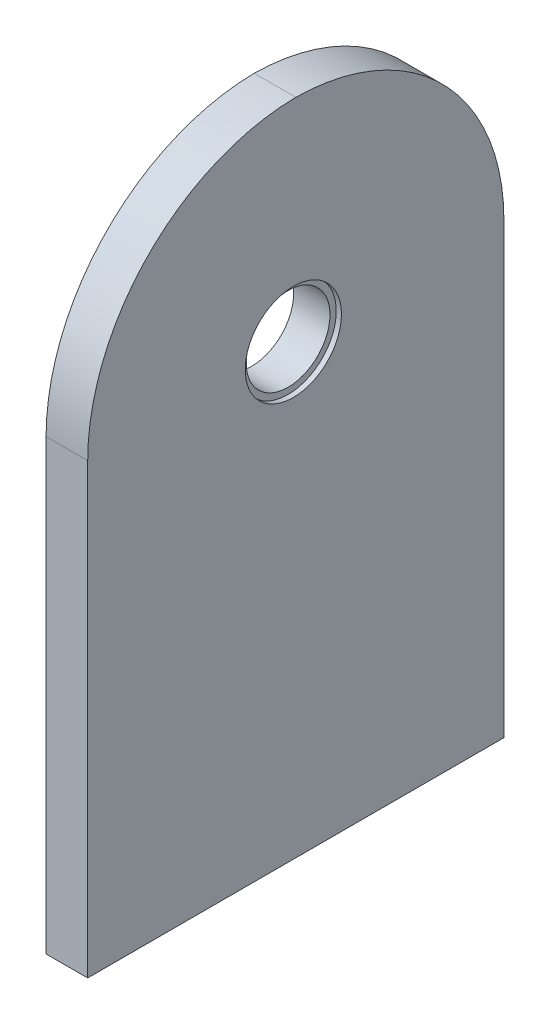
ISO-10303-21;
HEADER;
FILE_DESCRIPTION(('STEP AP214'),'2;1');
FILE_NAME('part.step','',(''),(''),'','','');
FILE_SCHEMA(('AUTOMOTIVE_DESIGN { 1 0 10303 214 1 1 1 1 }'));
ENDSEC;
DATA;
#1=APPLICATION_CONTEXT('core data for automotive mechanical design processes');
#2=APPLICATION_PROTOCOL_DEFINITION('international standard','automotive_design',2000,#1);
#3=PRODUCT_CONTEXT('',#1,'mechanical');
#4=PRODUCT('Part','Part','',(#3));
#5=PRODUCT_RELATED_PRODUCT_CATEGORY('part','',(#4));
#6=PRODUCT_DEFINITION_FORMATION('','',#4);
#7=PRODUCT_DEFINITION_CONTEXT('part definition',#1,'design');
#8=PRODUCT_DEFINITION('design','',#6,#7);
#9=PRODUCT_DEFINITION_SHAPE('','',#8);
#10=(LENGTH_UNIT() NAMED_UNIT(*) SI_UNIT(.MILLI.,.METRE.));
#11=(NAMED_UNIT(*) PLANE_ANGLE_UNIT() SI_UNIT($,.RADIAN.));
#12=(NAMED_UNIT(*) SI_UNIT($,.STERADIAN.) SOLID_ANGLE_UNIT());
#13=UNCERTAINTY_MEASURE_WITH_UNIT(LENGTH_MEASURE(1.E-05),#10,'distance_accuracy_value','');
#14=(GEOMETRIC_REPRESENTATION_CONTEXT(3) GLOBAL_UNCERTAINTY_ASSIGNED_CONTEXT((#13)) GLOBAL_UNIT_ASSIGNED_CONTEXT((#10,
#11,#12)) REPRESENTATION_CONTEXT('',''));
#15=CARTESIAN_POINT('',(0.,0.,0.));
#16=DIRECTION('',(0.,0.,1.));
#17=DIRECTION('',(1.,0.,0.));
#18=AXIS2_PLACEMENT_3D('',#15,#16,#17);
#19=CARTESIAN_POINT('',(144.666666666667,10.,39.6428499928494));
#20=DIRECTION('',(0.,1.,0.));
#21=DIRECTION('',(0.,0.,1.));
#22=AXIS2_PLACEMENT_3D('',#19,#20,#21);
#23=PLANE('',#22);
#24=CARTESIAN_POINT('',(64.,10.,30.));
#25=DIRECTION('',(0.,-1.,0.));
#26=DIRECTION('',(0.,0.,-1.));
#27=AXIS2_PLACEMENT_3D('',#24,#25,#26);
#28=CIRCLE('',#27,1.64999999999998);
#29=CARTESIAN_POINT('',(64.,10.,28.35));
#30=VERTEX_POINT('',#29);
#31=EDGE_CURVE('E104',#30,#30,#28,.T.);
#32=ORIENTED_EDGE('',*,*,#31,.F.);
#33=EDGE_LOOP('',(#32));
#34=FACE_BOUND('',#33,.T.);
#35=CARTESIAN_POINT('',(64.,10.,0.));
#36=DIRECTION('',(0.,-1.,0.));
#37=DIRECTION('',(0.,0.,-1.));
#38=AXIS2_PLACEMENT_3D('',#35,#36,#37);
#39=CIRCLE('',#38,1.64999999999998);
#40=CARTESIAN_POINT('',(64.,10.,-1.64999999999998));
#41=VERTEX_POINT('',#40);
#42=EDGE_CURVE('E103',#41,#41,#39,.T.);
#43=ORIENTED_EDGE('',*,*,#42,.F.);
#44=EDGE_LOOP('',(#43));
#45=FACE_BOUND('',#44,.T.);
#46=CARTESIAN_POINT('',(64.,10.,-30.));
#47=DIRECTION('',(0.,-1.,0.));
#48=DIRECTION('',(0.,0.,-1.));
#49=AXIS2_PLACEMENT_3D('',#46,#47,#48);
#50=CIRCLE('',#49,1.64999999999998);
#51=CARTESIAN_POINT('',(64.,10.,-31.65));
#52=VERTEX_POINT('',#51);
#53=EDGE_CURVE('E114',#52,#52,#50,.T.);
#54=ORIENTED_EDGE('',*,*,#53,.F.);
#55=EDGE_LOOP('',(#54));
#56=FACE_BOUND('',#55,.T.);
#57=DIRECTION('',(0.,0.,-1.));
#58=VECTOR('',#57,1.);
#59=CARTESIAN_POINT('',(68.,10.,-40.));
#60=LINE('',#59,#58);
#61=CARTESIAN_POINT('',(68.,10.,40.));
#62=VERTEX_POINT('',#61);
#63=CARTESIAN_POINT('',(68.,10.,-40.));
#64=VERTEX_POINT('',#63);
#65=EDGE_CURVE('E45',#62,#64,#60,.T.);
#66=ORIENTED_EDGE('',*,*,#65,.F.);
#67=DIRECTION('',(1.,0.,0.));
#68=VECTOR('',#67,1.);
#69=CARTESIAN_POINT('',(60.,10.,40.));
#70=LINE('',#69,#68);
#71=CARTESIAN_POINT('',(60.,10.,40.));
#72=VERTEX_POINT('',#71);
#73=EDGE_CURVE('E139',#72,#62,#70,.T.);
#74=ORIENTED_EDGE('',*,*,#73,.F.);
#75=DIRECTION('',(0.,0.,1.));
#76=VECTOR('',#75,1.);
#77=CARTESIAN_POINT('',(60.,10.,-40.));
#78=LINE('',#77,#76);
#79=CARTESIAN_POINT('',(60.,10.,-40.));
#80=VERTEX_POINT('',#79);
#81=EDGE_CURVE('E144',#80,#72,#78,.T.);
#82=ORIENTED_EDGE('',*,*,#81,.F.);
#83=DIRECTION('',(-1.,0.,0.));
#84=VECTOR('',#83,1.);
#85=CARTESIAN_POINT('',(60.,10.,-40.));
#86=LINE('',#85,#84);
#87=EDGE_CURVE('E149',#64,#80,#86,.T.);
#88=ORIENTED_EDGE('',*,*,#87,.F.);
#89=EDGE_LOOP('',(#66,#74,#82,#88));
#90=FACE_BOUND('',#89,.T.);
#91=ADVANCED_FACE('F41',(#34,#45,#56,#90),#23,.F.);
#92=CARTESIAN_POINT('',(60.,136.594137144496,0.));
#93=DIRECTION('',(-1.,0.,0.));
#94=DIRECTION('',(0.,0.,1.));
#95=AXIS2_PLACEMENT_3D('',#92,#93,#94);
#96=PLANE('',#95);
#97=CARTESIAN_POINT('',(60.,96.1169830943412,0.47999999999996));
#98=DIRECTION('',(1.,0.,0.));
#99=DIRECTION('',(0.,0.,-1.));
#100=AXIS2_PLACEMENT_3D('',#97,#98,#99);
#101=CIRCLE('',#100,8.05);
#102=CARTESIAN_POINT('',(60.,96.1169830943412,-7.57000000000004));
#103=VERTEX_POINT('',#102);
#104=EDGE_CURVE('E121',#103,#103,#101,.T.);
#105=ORIENTED_EDGE('',*,*,#104,.T.);
#106=EDGE_LOOP('',(#105));
#107=FACE_BOUND('',#106,.T.);
#108=CARTESIAN_POINT('',(60.,96.1169830943412,-0.48000000000005));
#109=DIRECTION('',(1.,0.,0.));
#110=DIRECTION('',(0.,0.,-1.));
#111=AXIS2_PLACEMENT_3D('',#108,#109,#110);
#112=CIRCLE('',#111,40.48);
#113=CARTESIAN_POINT('',(60.,96.1169830943412,40.));
#114=VERTEX_POINT('',#113);
#115=CARTESIAN_POINT('',(60.,136.594137144496,0.));
#116=VERTEX_POINT('',#115);
#117=EDGE_CURVE('E150',#114,#116,#112,.F.);
#118=ORIENTED_EDGE('',*,*,#117,.T.);
#119=CARTESIAN_POINT('',(60.,96.1169830943412,0.47999999999996));
#120=DIRECTION('',(1.,0.,0.));
#121=DIRECTION('',(0.,0.,-1.));
#122=AXIS2_PLACEMENT_3D('',#119,#120,#121);
#123=CIRCLE('',#122,40.48);
#124=CARTESIAN_POINT('',(60.,96.1169830943412,-40.));
#125=VERTEX_POINT('',#124);
#126=EDGE_CURVE('E143',#116,#125,#123,.F.);
#127=ORIENTED_EDGE('',*,*,#126,.T.);
#128=DIRECTION('',(0.,-1.,0.));
#129=VECTOR('',#128,1.);
#130=CARTESIAN_POINT('',(60.,136.596983094341,-40.));
#131=LINE('',#130,#129);
#132=EDGE_CURVE('E140',#125,#80,#131,.T.);
#133=ORIENTED_EDGE('',*,*,#132,.T.);
#134=ORIENTED_EDGE('',*,*,#81,.T.);
#135=DIRECTION('',(0.,-1.,0.));
#136=VECTOR('',#135,1.);
#137=CARTESIAN_POINT('',(60.,136.596983094341,40.));
#138=LINE('',#137,#136);
#139=EDGE_CURVE('E135',#114,#72,#138,.T.);
#140=ORIENTED_EDGE('',*,*,#139,.F.);
#141=EDGE_LOOP('',(#118,#127,#133,#134,#140));
#142=FACE_BOUND('',#141,.T.);
#143=ADVANCED_FACE('F164',(#107,#142),#96,.T.);
#144=CARTESIAN_POINT('',(68.,96.1169830943412,-40.));
#145=DIRECTION('',(1.,0.,0.));
#146=DIRECTION('',(0.,0.,-1.));
#147=AXIS2_PLACEMENT_3D('',#144,#145,#146);
#148=PLANE('',#147);
#149=CARTESIAN_POINT('',(68.,96.1169830943412,0.47999999999996));
#150=DIRECTION('',(1.,0.,0.));
#151=DIRECTION('',(0.,0.,-1.));
#152=AXIS2_PLACEMENT_3D('',#149,#150,#151);
#153=CIRCLE('',#152,9.25);
#154=CARTESIAN_POINT('',(68.,96.1169830943412,-8.77000000000004));
#155=VERTEX_POINT('',#154);
#156=EDGE_CURVE('E124',#155,#155,#153,.T.);
#157=ORIENTED_EDGE('',*,*,#156,.F.);
#158=EDGE_LOOP('',(#157));
#159=FACE_BOUND('',#158,.T.);
#160=DIRECTION('',(0.,-1.,0.));
#161=VECTOR('',#160,1.);
#162=CARTESIAN_POINT('',(68.,136.596983094341,-40.));
#163=LINE('',#162,#161);
#164=CARTESIAN_POINT('',(68.,96.1169830943412,-40.));
#165=VERTEX_POINT('',#164);
#166=EDGE_CURVE('E145',#165,#64,#163,.T.);
#167=ORIENTED_EDGE('',*,*,#166,.F.);
#168=CARTESIAN_POINT('',(68.,96.1169830943412,0.47999999999996));
#169=DIRECTION('',(-1.,0.,0.));
#170=DIRECTION('',(0.,0.,1.));
#171=AXIS2_PLACEMENT_3D('',#168,#169,#170);
#172=CIRCLE('',#171,40.48);
#173=CARTESIAN_POINT('',(68.,136.594137144496,0.));
#174=VERTEX_POINT('',#173);
#175=EDGE_CURVE('E11',#165,#174,#172,.F.);
#176=ORIENTED_EDGE('',*,*,#175,.T.);
#177=CARTESIAN_POINT('',(68.,96.1169830943412,-0.48000000000005));
#178=DIRECTION('',(-1.,0.,0.));
#179=DIRECTION('',(0.,0.,1.));
#180=AXIS2_PLACEMENT_3D('',#177,#178,#179);
#181=CIRCLE('',#180,40.48);
#182=CARTESIAN_POINT('',(68.,96.1169830943412,40.));
#183=VERTEX_POINT('',#182);
#184=EDGE_CURVE('E50',#174,#183,#181,.F.);
#185=ORIENTED_EDGE('',*,*,#184,.T.);
#186=DIRECTION('',(0.,-1.,0.));
#187=VECTOR('',#186,1.);
#188=CARTESIAN_POINT('',(68.,136.596983094341,40.));
#189=LINE('',#188,#187);
#190=EDGE_CURVE('E133',#183,#62,#189,.T.);
#191=ORIENTED_EDGE('',*,*,#190,.T.);
#192=ORIENTED_EDGE('',*,*,#65,.T.);
#193=EDGE_LOOP('',(#167,#176,#185,#191,#192));
#194=FACE_BOUND('',#193,.T.);
#195=ADVANCED_FACE('F43',(#159,#194),#148,.T.);
#196=CARTESIAN_POINT('',(60.,136.596983094341,40.));
#197=DIRECTION('',(0.,0.,-1.));
#198=DIRECTION('',(-1.,0.,0.));
#199=AXIS2_PLACEMENT_3D('',#196,#197,#198);
#200=PLANE('',#199);
#201=ORIENTED_EDGE('',*,*,#190,.F.);
#202=DIRECTION('',(1.,0.,0.));
#203=VECTOR('',#202,1.);
#204=CARTESIAN_POINT('',(60.,96.1169830943412,40.));
#205=LINE('',#204,#203);
#206=EDGE_CURVE('E138',#183,#114,#205,.F.);
#207=ORIENTED_EDGE('',*,*,#206,.T.);
#208=ORIENTED_EDGE('',*,*,#139,.T.);
#209=ORIENTED_EDGE('',*,*,#73,.T.);
#210=EDGE_LOOP('',(#201,#207,#208,#209));
#211=FACE_BOUND('',#210,.T.);
#212=ADVANCED_FACE('F171',(#211),#200,.F.);
#213=CARTESIAN_POINT('',(0.,96.1169830943412,-0.48000000000005));
#214=DIRECTION('',(-1.,0.,0.));
#215=DIRECTION('',(0.,0.,1.));
#216=AXIS2_PLACEMENT_3D('',#213,#214,#215);
#217=CYLINDRICAL_SURFACE('',#216,40.48);
#218=ORIENTED_EDGE('',*,*,#206,.F.);
#219=ORIENTED_EDGE('',*,*,#184,.F.);
#220=DIRECTION('',(-1.,0.,0.));
#221=VECTOR('',#220,1.);
#222=CARTESIAN_POINT('',(64.,136.594137144496,0.));
#223=LINE('',#222,#221);
#224=EDGE_CURVE('E130',#116,#174,#223,.F.);
#225=ORIENTED_EDGE('',*,*,#224,.F.);
#226=ORIENTED_EDGE('',*,*,#117,.F.);
#227=EDGE_LOOP('',(#218,#219,#225,#226));
#228=FACE_BOUND('',#227,.T.);
#229=ADVANCED_FACE('F174',(#228),#217,.T.);
#230=CARTESIAN_POINT('',(60.,136.596983094341,-40.));
#231=DIRECTION('',(0.,0.,1.));
#232=DIRECTION('',(1.,0.,0.));
#233=AXIS2_PLACEMENT_3D('',#230,#231,#232);
#234=PLANE('',#233);
#235=ORIENTED_EDGE('',*,*,#132,.F.);
#236=DIRECTION('',(-1.,0.,0.));
#237=VECTOR('',#236,1.);
#238=CARTESIAN_POINT('',(68.,96.1169830943412,-40.));
#239=LINE('',#238,#237);
#240=EDGE_CURVE('E148',#125,#165,#239,.F.);
#241=ORIENTED_EDGE('',*,*,#240,.T.);
#242=ORIENTED_EDGE('',*,*,#166,.T.);
#243=ORIENTED_EDGE('',*,*,#87,.T.);
#244=EDGE_LOOP('',(#235,#241,#242,#243));
#245=FACE_BOUND('',#244,.T.);
#246=ADVANCED_FACE('F180',(#245),#234,.F.);
#247=CARTESIAN_POINT('',(0.,96.1169830943412,0.47999999999996));
#248=DIRECTION('',(1.,0.,0.));
#249=DIRECTION('',(0.,0.,-1.));
#250=AXIS2_PLACEMENT_3D('',#247,#248,#249);
#251=CYLINDRICAL_SURFACE('',#250,40.48);
#252=ORIENTED_EDGE('',*,*,#175,.F.);
#253=ORIENTED_EDGE('',*,*,#240,.F.);
#254=ORIENTED_EDGE('',*,*,#126,.F.);
#255=ORIENTED_EDGE('',*,*,#224,.T.);
#256=EDGE_LOOP('',(#252,#253,#254,#255));
#257=FACE_BOUND('',#256,.T.);
#258=ADVANCED_FACE('F181',(#257),#251,.T.);
#259=CARTESIAN_POINT('',(67.,96.1169830943412,0.47999999999996));
#260=DIRECTION('',(1.,0.,0.));
#261=DIRECTION('',(0.,0.,-1.));
#262=AXIS2_PLACEMENT_3D('',#259,#260,#261);
#263=CYLINDRICAL_SURFACE('',#262,9.25);
#264=CARTESIAN_POINT('',(67.,96.1169830943412,0.47999999999996));
#265=DIRECTION('',(1.,0.,0.));
#266=DIRECTION('',(0.,0.,-1.));
#267=AXIS2_PLACEMENT_3D('',#264,#265,#266);
#268=CIRCLE('',#267,9.25);
#269=CARTESIAN_POINT('',(67.,96.1169830943412,-8.77000000000004));
#270=VERTEX_POINT('',#269);
#271=EDGE_CURVE('E127',#270,#270,#268,.T.);
#272=ORIENTED_EDGE('',*,*,#271,.F.);
#273=EDGE_LOOP('',(#272));
#274=FACE_BOUND('',#273,.T.);
#275=ORIENTED_EDGE('',*,*,#156,.T.);
#276=EDGE_LOOP('',(#275));
#277=FACE_BOUND('',#276,.T.);
#278=ADVANCED_FACE('F183',(#274,#277),#263,.F.);
#279=CARTESIAN_POINT('',(67.,96.1169830943412,0.47999999999996));
#280=DIRECTION('',(1.,0.,0.));
#281=DIRECTION('',(0.,0.,-1.));
#282=AXIS2_PLACEMENT_3D('',#279,#280,#281);
#283=PLANE('',#282);
#284=CARTESIAN_POINT('',(67.,96.1169830943412,0.47999999999996));
#285=DIRECTION('',(1.,0.,0.));
#286=DIRECTION('',(0.,0.,-1.));
#287=AXIS2_PLACEMENT_3D('',#284,#285,#286);
#288=CIRCLE('',#287,8.05);
#289=CARTESIAN_POINT('',(67.,96.1169830943412,-7.57000000000004));
#290=VERTEX_POINT('',#289);
#291=EDGE_CURVE('E120',#290,#290,#288,.T.);
#292=ORIENTED_EDGE('',*,*,#291,.F.);
#293=EDGE_LOOP('',(#292));
#294=FACE_BOUND('',#293,.T.);
#295=ORIENTED_EDGE('',*,*,#271,.T.);
#296=EDGE_LOOP('',(#295));
#297=FACE_BOUND('',#296,.T.);
#298=ADVANCED_FACE('F191',(#294,#297),#283,.T.);
#299=CARTESIAN_POINT('',(60.,96.1169830943412,0.47999999999996));
#300=DIRECTION('',(1.,0.,0.));
#301=DIRECTION('',(0.,0.,-1.));
#302=AXIS2_PLACEMENT_3D('',#299,#300,#301);
#303=CYLINDRICAL_SURFACE('',#302,8.05);
#304=CARTESIAN_POINT('',(60.,96.1169830943412,-7.57000000000004));
#305=CARTESIAN_POINT('',(60.0729166666667,96.1169830943412,-7.57000000000004));
#306=CARTESIAN_POINT('',(60.1458333333333,96.1169830943412,-7.57000000000004));
#307=CARTESIAN_POINT('',(60.2916666666667,96.1169830943412,-7.57000000000004));
#308=CARTESIAN_POINT('',(60.3645833333333,96.1169830943412,-7.57000000000004));
#309=CARTESIAN_POINT('',(60.5104166666667,96.1169830943412,-7.57000000000004));
#310=CARTESIAN_POINT('',(60.5833333333333,96.1169830943412,-7.57000000000004));
#311=CARTESIAN_POINT('',(60.7291666666667,96.1169830943412,-7.57000000000004));
#312=CARTESIAN_POINT('',(60.8020833333333,96.1169830943412,-7.57000000000004));
#313=CARTESIAN_POINT('',(60.9479166666667,96.1169830943412,-7.57000000000004));
#314=CARTESIAN_POINT('',(61.0208333333333,96.1169830943412,-7.57000000000004));
#315=CARTESIAN_POINT('',(61.1666666666667,96.1169830943412,-7.57000000000004));
#316=CARTESIAN_POINT('',(61.2395833333333,96.1169830943412,-7.57000000000004));
#317=CARTESIAN_POINT('',(61.3854166666667,96.1169830943412,-7.57000000000004));
#318=CARTESIAN_POINT('',(61.4583333333333,96.1169830943412,-7.57000000000004));
#319=CARTESIAN_POINT('',(61.6041666666667,96.1169830943412,-7.57000000000004));
#320=CARTESIAN_POINT('',(61.6770833333333,96.1169830943412,-7.57000000000004));
#321=CARTESIAN_POINT('',(61.8229166666667,96.1169830943412,-7.57000000000004));
#322=CARTESIAN_POINT('',(61.8958333333333,96.1169830943412,-7.57000000000004));
#323=CARTESIAN_POINT('',(62.0416666666667,96.1169830943412,-7.57000000000004));
#324=CARTESIAN_POINT('',(62.1145833333333,96.1169830943412,-7.57000000000004));
#325=CARTESIAN_POINT('',(62.2604166666667,96.1169830943412,-7.57000000000004));
#326=CARTESIAN_POINT('',(62.3333333333333,96.1169830943412,-7.57000000000004));
#327=CARTESIAN_POINT('',(62.4791666666667,96.1169830943412,-7.57000000000004));
#328=CARTESIAN_POINT('',(62.5520833333333,96.1169830943412,-7.57000000000004));
#329=CARTESIAN_POINT('',(62.6979166666667,96.1169830943412,-7.57000000000004));
#330=CARTESIAN_POINT('',(62.7708333333333,96.1169830943412,-7.57000000000004));
#331=CARTESIAN_POINT('',(62.9166666666667,96.1169830943412,-7.57000000000004));
#332=CARTESIAN_POINT('',(62.9895833333333,96.1169830943412,-7.57000000000004));
#333=CARTESIAN_POINT('',(63.1354166666667,96.1169830943412,-7.57000000000004));
#334=CARTESIAN_POINT('',(63.2083333333333,96.1169830943412,-7.57000000000004));
#335=CARTESIAN_POINT('',(63.3541666666667,96.1169830943412,-7.57000000000004));
#336=CARTESIAN_POINT('',(63.4270833333333,96.1169830943412,-7.57000000000004));
#337=CARTESIAN_POINT('',(63.5729166666667,96.1169830943412,-7.57000000000004));
#338=CARTESIAN_POINT('',(63.6458333333333,96.1169830943412,-7.57000000000004));
#339=CARTESIAN_POINT('',(63.7916666666667,96.1169830943412,-7.57000000000004));
#340=CARTESIAN_POINT('',(63.8645833333333,96.1169830943412,-7.57000000000004));
#341=CARTESIAN_POINT('',(64.0104166666667,96.1169830943412,-7.57000000000004));
#342=CARTESIAN_POINT('',(64.0833333333333,96.1169830943412,-7.57000000000004));
#343=CARTESIAN_POINT('',(64.2291666666667,96.1169830943412,-7.57000000000004));
#344=CARTESIAN_POINT('',(64.3020833333333,96.1169830943412,-7.57000000000004));
#345=CARTESIAN_POINT('',(64.4479166666667,96.1169830943412,-7.57000000000004));
#346=CARTESIAN_POINT('',(64.5208333333333,96.1169830943412,-7.57000000000004));
#347=CARTESIAN_POINT('',(64.6666666666667,96.1169830943412,-7.57000000000004));
#348=CARTESIAN_POINT('',(64.7395833333333,96.1169830943412,-7.57000000000004));
#349=CARTESIAN_POINT('',(64.8854166666667,96.1169830943412,-7.57000000000004));
#350=CARTESIAN_POINT('',(64.9583333333333,96.1169830943412,-7.57000000000004));
#351=CARTESIAN_POINT('',(65.1041666666667,96.1169830943412,-7.57000000000004));
#352=CARTESIAN_POINT('',(65.1770833333333,96.1169830943412,-7.57000000000004));
#353=CARTESIAN_POINT('',(65.3229166666667,96.1169830943412,-7.57000000000004));
#354=CARTESIAN_POINT('',(65.3958333333333,96.1169830943412,-7.57000000000004));
#355=CARTESIAN_POINT('',(65.5416666666667,96.1169830943412,-7.57000000000004));
#356=CARTESIAN_POINT('',(65.6145833333333,96.1169830943412,-7.57000000000004));
#357=CARTESIAN_POINT('',(65.7604166666667,96.1169830943412,-7.57000000000004));
#358=CARTESIAN_POINT('',(65.8333333333333,96.1169830943412,-7.57000000000004));
#359=CARTESIAN_POINT('',(65.9791666666667,96.1169830943412,-7.57000000000004));
#360=CARTESIAN_POINT('',(66.0520833333333,96.1169830943412,-7.57000000000004));
#361=CARTESIAN_POINT('',(66.1979166666667,96.1169830943412,-7.57000000000004));
#362=CARTESIAN_POINT('',(66.2708333333333,96.1169830943412,-7.57000000000004));
#363=CARTESIAN_POINT('',(66.4166666666667,96.1169830943412,-7.57000000000004));
#364=CARTESIAN_POINT('',(66.4895833333333,96.1169830943412,-7.57000000000004));
#365=CARTESIAN_POINT('',(66.6354166666667,96.1169830943412,-7.57000000000004));
#366=CARTESIAN_POINT('',(66.7083333333333,96.1169830943412,-7.57000000000004));
#367=CARTESIAN_POINT('',(66.8541666666667,96.1169830943412,-7.57000000000004));
#368=CARTESIAN_POINT('',(66.9270833333333,96.1169830943412,-7.57000000000004));
#369=CARTESIAN_POINT('',(67.,96.1169830943412,-7.57000000000004));
#370=B_SPLINE_CURVE_WITH_KNOTS('',3,(#304,#305,#306,#307,#308,#309,#310,#311,#312,#313,#314,
#315,#316,#317,#318,#319,#320,#321,#322,#323,#324,#325,#326,#327,#328,#329,#330,#331,#332,#333,
#334,#335,#336,#337,#338,#339,#340,#341,#342,#343,#344,#345,#346,#347,#348,#349,#350,#351,#352,
#353,#354,#355,#356,#357,#358,#359,#360,#361,#362,#363,#364,#365,#366,#367,#368,#369),
.UNSPECIFIED.,.F.,.F.,(4,2,2,2,2,2,2,2,2,2,2,2,2,2,2,2,2,2,2,2,2,2,2,2,2,2,2,2,2,2,2,2,4),(0.,
0.218749999999997,0.437499999999993,0.656249999999997,0.874999999999994,1.09375,
1.31249999999999,1.53125,1.74999999999999,1.96875,2.1875,2.40625,2.625,2.84374999999999,3.0625,
3.28125,3.5,3.71874999999999,3.9375,4.15625,4.375,4.59374999999999,4.8125,5.03125,5.25,
5.46874999999999,5.6875,5.90625,6.12499999999999,6.34375,6.5625,6.78125,6.99999999999999),.UNSPECIFIED.);
#371=EDGE_CURVE('BSEAM219',#103,#290,#370,.T.);
#372=ORIENTED_EDGE('',*,*,#104,.F.);
#373=ORIENTED_EDGE('',*,*,#291,.T.);
#374=ORIENTED_EDGE('',*,*,#371,.T.);
#375=ORIENTED_EDGE('',*,*,#371,.F.);
#376=EDGE_LOOP('',(#372,#374,#373,#375));
#377=FACE_BOUND('',#376,.T.);
#378=ADVANCED_FACE('F219',(#377),#303,.F.);
#379=CARTESIAN_POINT('',(64.,45.,-30.));
#380=DIRECTION('',(0.,-1.,0.));
#381=DIRECTION('',(0.,0.,-1.));
#382=AXIS2_PLACEMENT_3D('',#379,#380,#381);
#383=CONICAL_SURFACE('',#382,1.65,1.02974425867665);
#384=CARTESIAN_POINT('',(64.,45.9914200213955,-30.));
#385=VERTEX_POINT('',#384);
#386=VERTEX_LOOP('',#385);
#387=FACE_BOUND('',#386,.T.);
#388=CARTESIAN_POINT('',(64.,45.,-30.));
#389=DIRECTION('',(0.,-1.,0.));
#390=DIRECTION('',(0.,0.,-1.));
#391=AXIS2_PLACEMENT_3D('',#388,#389,#390);
#392=CIRCLE('',#391,1.65);
#393=CARTESIAN_POINT('',(64.,45.,-31.65));
#394=VERTEX_POINT('',#393);
#395=EDGE_CURVE('E117',#394,#394,#392,.T.);
#396=ORIENTED_EDGE('',*,*,#395,.T.);
#397=EDGE_LOOP('',(#396));
#398=FACE_BOUND('',#397,.T.);
#399=ADVANCED_FACE('F222',(#387,#398),#383,.F.);
#400=CARTESIAN_POINT('',(64.,10.,-30.));
#401=DIRECTION('',(0.,-1.,0.));
#402=DIRECTION('',(0.,0.,-1.));
#403=AXIS2_PLACEMENT_3D('',#400,#401,#402);
#404=CYLINDRICAL_SURFACE('',#403,1.64999999999999);
#405=ORIENTED_EDGE('',*,*,#395,.F.);
#406=EDGE_LOOP('',(#405));
#407=FACE_BOUND('',#406,.T.);
#408=ORIENTED_EDGE('',*,*,#53,.T.);
#409=EDGE_LOOP('',(#408));
#410=FACE_BOUND('',#409,.T.);
#411=ADVANCED_FACE('F225',(#407,#410),#404,.F.);
#412=CARTESIAN_POINT('',(64.,45.,0.));
#413=DIRECTION('',(0.,-1.,0.));
#414=DIRECTION('',(0.,0.,-1.));
#415=AXIS2_PLACEMENT_3D('',#412,#413,#414);
#416=CONICAL_SURFACE('',#415,1.65,1.02974425867665);
#417=CARTESIAN_POINT('',(64.,45.9914200213955,0.));
#418=VERTEX_POINT('',#417);
#419=VERTEX_LOOP('',#418);
#420=FACE_BOUND('',#419,.T.);
#421=CARTESIAN_POINT('',(64.,45.,0.));
#422=DIRECTION('',(0.,-1.,0.));
#423=DIRECTION('',(0.,0.,-1.));
#424=AXIS2_PLACEMENT_3D('',#421,#422,#423);
#425=CIRCLE('',#424,1.65);
#426=CARTESIAN_POINT('',(64.,45.,-1.65));
#427=VERTEX_POINT('',#426);
#428=EDGE_CURVE('E107',#427,#427,#425,.T.);
#429=ORIENTED_EDGE('',*,*,#428,.T.);
#430=EDGE_LOOP('',(#429));
#431=FACE_BOUND('',#430,.T.);
#432=ADVANCED_FACE('F229',(#420,#431),#416,.F.);
#433=CARTESIAN_POINT('',(64.,10.,0.));
#434=DIRECTION('',(0.,-1.,0.));
#435=DIRECTION('',(0.,0.,-1.));
#436=AXIS2_PLACEMENT_3D('',#433,#434,#435);
#437=CYLINDRICAL_SURFACE('',#436,1.64999999999999);
#438=ORIENTED_EDGE('',*,*,#428,.F.);
#439=EDGE_LOOP('',(#438));
#440=FACE_BOUND('',#439,.T.);
#441=ORIENTED_EDGE('',*,*,#42,.T.);
#442=EDGE_LOOP('',(#441));
#443=FACE_BOUND('',#442,.T.);
#444=ADVANCED_FACE('F97',(#440,#443),#437,.F.);
#445=CARTESIAN_POINT('',(64.,45.,30.));
#446=DIRECTION('',(0.,-1.,0.));
#447=DIRECTION('',(0.,0.,-1.));
#448=AXIS2_PLACEMENT_3D('',#445,#446,#447);
#449=CONICAL_SURFACE('',#448,1.65,1.02974425867665);
#450=CARTESIAN_POINT('',(64.,45.9914200213955,30.));
#451=VERTEX_POINT('',#450);
#452=VERTEX_LOOP('',#451);
#453=FACE_BOUND('',#452,.T.);
#454=CARTESIAN_POINT('',(64.,45.,30.));
#455=DIRECTION('',(0.,-1.,0.));
#456=DIRECTION('',(0.,0.,-1.));
#457=AXIS2_PLACEMENT_3D('',#454,#455,#456);
#458=CIRCLE('',#457,1.65);
#459=CARTESIAN_POINT('',(64.,45.,28.35));
#460=VERTEX_POINT('',#459);
#461=EDGE_CURVE('E101',#460,#460,#458,.T.);
#462=ORIENTED_EDGE('',*,*,#461,.T.);
#463=EDGE_LOOP('',(#462));
#464=FACE_BOUND('',#463,.T.);
#465=ADVANCED_FACE('F93',(#453,#464),#449,.F.);
#466=CARTESIAN_POINT('',(64.,10.,30.));
#467=DIRECTION('',(0.,-1.,0.));
#468=DIRECTION('',(0.,0.,-1.));
#469=AXIS2_PLACEMENT_3D('',#466,#467,#468);
#470=CYLINDRICAL_SURFACE('',#469,1.64999999999999);
#471=ORIENTED_EDGE('',*,*,#461,.F.);
#472=EDGE_LOOP('',(#471));
#473=FACE_BOUND('',#472,.T.);
#474=ORIENTED_EDGE('',*,*,#31,.T.);
#475=EDGE_LOOP('',(#474));
#476=FACE_BOUND('',#475,.T.);
#477=ADVANCED_FACE('F96',(#473,#476),#470,.F.);
#478=CLOSED_SHELL('',(#91,#143,#195,#212,#229,#246,#258,#278,#298,#378,#399,#411,#432,#444,#465,#477));
#479=MANIFOLD_SOLID_BREP('B2',#478);
#480=ADVANCED_BREP_SHAPE_REPRESENTATION('',(#18,#479),#14);
#481=SHAPE_DEFINITION_REPRESENTATION(#9,#480);
ENDSEC;
END-ISO-10303-21;
